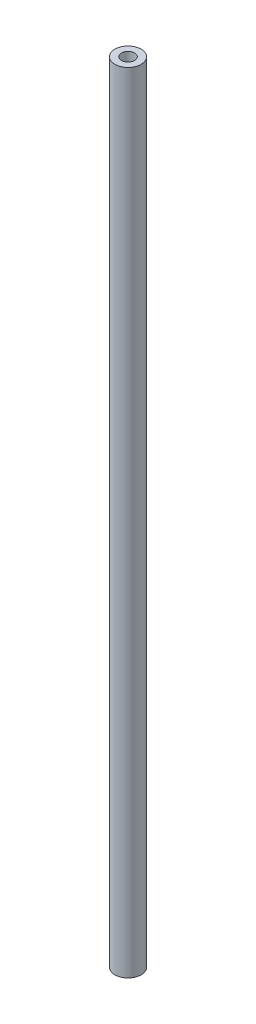
ISO-10303-21;
HEADER;
FILE_DESCRIPTION(('STEP AP214'),'2;1');
FILE_NAME('part.step','',(''),(''),'','','');
FILE_SCHEMA(('AUTOMOTIVE_DESIGN { 1 0 10303 214 1 1 1 1 }'));
ENDSEC;
DATA;
#1=APPLICATION_CONTEXT('core data for automotive mechanical design processes');
#2=APPLICATION_PROTOCOL_DEFINITION('international standard','automotive_design',2000,#1);
#3=PRODUCT_CONTEXT('',#1,'mechanical');
#4=PRODUCT('Part','Part','',(#3));
#5=PRODUCT_RELATED_PRODUCT_CATEGORY('part','',(#4));
#6=PRODUCT_DEFINITION_FORMATION('','',#4);
#7=PRODUCT_DEFINITION_CONTEXT('part definition',#1,'design');
#8=PRODUCT_DEFINITION('design','',#6,#7);
#9=PRODUCT_DEFINITION_SHAPE('','',#8);
#10=(LENGTH_UNIT() NAMED_UNIT(*) SI_UNIT(.MILLI.,.METRE.));
#11=(NAMED_UNIT(*) PLANE_ANGLE_UNIT() SI_UNIT($,.RADIAN.));
#12=(NAMED_UNIT(*) SI_UNIT($,.STERADIAN.) SOLID_ANGLE_UNIT());
#13=UNCERTAINTY_MEASURE_WITH_UNIT(LENGTH_MEASURE(1.E-05),#10,'distance_accuracy_value','');
#14=(GEOMETRIC_REPRESENTATION_CONTEXT(3) GLOBAL_UNCERTAINTY_ASSIGNED_CONTEXT((#13)) GLOBAL_UNIT_ASSIGNED_CONTEXT((#10,
#11,#12)) REPRESENTATION_CONTEXT('',''));
#15=CARTESIAN_POINT('',(0.,0.,0.));
#16=DIRECTION('',(0.,0.,1.));
#17=DIRECTION('',(1.,0.,0.));
#18=AXIS2_PLACEMENT_3D('',#15,#16,#17);
#19=CARTESIAN_POINT('',(0.,180.,0.));
#20=DIRECTION('',(0.,-1.,0.));
#21=DIRECTION('',(0.,0.,-1.));
#22=AXIS2_PLACEMENT_3D('',#19,#20,#21);
#23=CYLINDRICAL_SURFACE('',#22,1.5);
#24=CARTESIAN_POINT('',(0.,180.,0.));
#25=DIRECTION('',(0.,-1.,0.));
#26=DIRECTION('',(0.,0.,-1.));
#27=AXIS2_PLACEMENT_3D('',#24,#25,#26);
#28=CIRCLE('',#27,1.5);
#29=CARTESIAN_POINT('',(0.,180.,-1.5));
#30=VERTEX_POINT('',#29);
#31=EDGE_CURVE('E18',#30,#30,#28,.T.);
#32=ORIENTED_EDGE('',*,*,#31,.F.);
#33=EDGE_LOOP('',(#32));
#34=FACE_BOUND('',#33,.T.);
#35=CARTESIAN_POINT('',(0.,0.,0.));
#36=DIRECTION('',(0.,-1.,0.));
#37=DIRECTION('',(0.,0.,-1.));
#38=AXIS2_PLACEMENT_3D('',#35,#36,#37);
#39=CIRCLE('',#38,1.5);
#40=CARTESIAN_POINT('',(0.,0.,-1.5));
#41=VERTEX_POINT('',#40);
#42=EDGE_CURVE('E27',#41,#41,#39,.T.);
#43=ORIENTED_EDGE('',*,*,#42,.T.);
#44=EDGE_LOOP('',(#43));
#45=FACE_BOUND('',#44,.T.);
#46=ADVANCED_FACE('F15',(#34,#45),#23,.F.);
#47=CARTESIAN_POINT('',(0.,180.,0.));
#48=DIRECTION('',(0.,1.,0.));
#49=DIRECTION('',(0.,0.,1.));
#50=AXIS2_PLACEMENT_3D('',#47,#48,#49);
#51=PLANE('',#50);
#52=CARTESIAN_POINT('',(0.,180.,0.));
#53=DIRECTION('',(0.,-1.,0.));
#54=DIRECTION('',(0.,0.,-1.));
#55=AXIS2_PLACEMENT_3D('',#52,#53,#54);
#56=CIRCLE('',#55,3.);
#57=CARTESIAN_POINT('',(0.,180.,-3.));
#58=VERTEX_POINT('',#57);
#59=EDGE_CURVE('E22',#58,#58,#56,.T.);
#60=ORIENTED_EDGE('',*,*,#59,.F.);
#61=EDGE_LOOP('',(#60));
#62=FACE_BOUND('',#61,.T.);
#63=ORIENTED_EDGE('',*,*,#31,.T.);
#64=EDGE_LOOP('',(#63));
#65=FACE_BOUND('',#64,.T.);
#66=ADVANCED_FACE('F35',(#62,#65),#51,.T.);
#67=CARTESIAN_POINT('',(0.,0.,0.));
#68=DIRECTION('',(0.,1.,0.));
#69=DIRECTION('',(0.,0.,1.));
#70=AXIS2_PLACEMENT_3D('',#67,#68,#69);
#71=PLANE('',#70);
#72=CARTESIAN_POINT('',(0.,0.,0.));
#73=DIRECTION('',(0.,-1.,0.));
#74=DIRECTION('',(0.,0.,-1.));
#75=AXIS2_PLACEMENT_3D('',#72,#73,#74);
#76=CIRCLE('',#75,3.);
#77=CARTESIAN_POINT('',(0.,0.,-3.));
#78=VERTEX_POINT('',#77);
#79=EDGE_CURVE('E10',#78,#78,#76,.F.);
#80=ORIENTED_EDGE('',*,*,#79,.F.);
#81=EDGE_LOOP('',(#80));
#82=FACE_BOUND('',#81,.T.);
#83=ORIENTED_EDGE('',*,*,#42,.F.);
#84=EDGE_LOOP('',(#83));
#85=FACE_BOUND('',#84,.T.);
#86=ADVANCED_FACE('F42',(#82,#85),#71,.F.);
#87=CARTESIAN_POINT('',(0.,180.,0.));
#88=DIRECTION('',(0.,-1.,0.));
#89=DIRECTION('',(0.,0.,-1.));
#90=AXIS2_PLACEMENT_3D('',#87,#88,#89);
#91=CYLINDRICAL_SURFACE('',#90,3.);
#92=ORIENTED_EDGE('',*,*,#79,.T.);
#93=EDGE_LOOP('',(#92));
#94=FACE_BOUND('',#93,.T.);
#95=ORIENTED_EDGE('',*,*,#59,.T.);
#96=EDGE_LOOP('',(#95));
#97=FACE_BOUND('',#96,.T.);
#98=ADVANCED_FACE('F44',(#94,#97),#91,.T.);
#99=CLOSED_SHELL('',(#46,#66,#86,#98));
#100=MANIFOLD_SOLID_BREP('B1',#99);
#101=ADVANCED_BREP_SHAPE_REPRESENTATION('',(#18,#100),#14);
#102=SHAPE_DEFINITION_REPRESENTATION(#9,#101);
ENDSEC;
END-ISO-10303-21;
